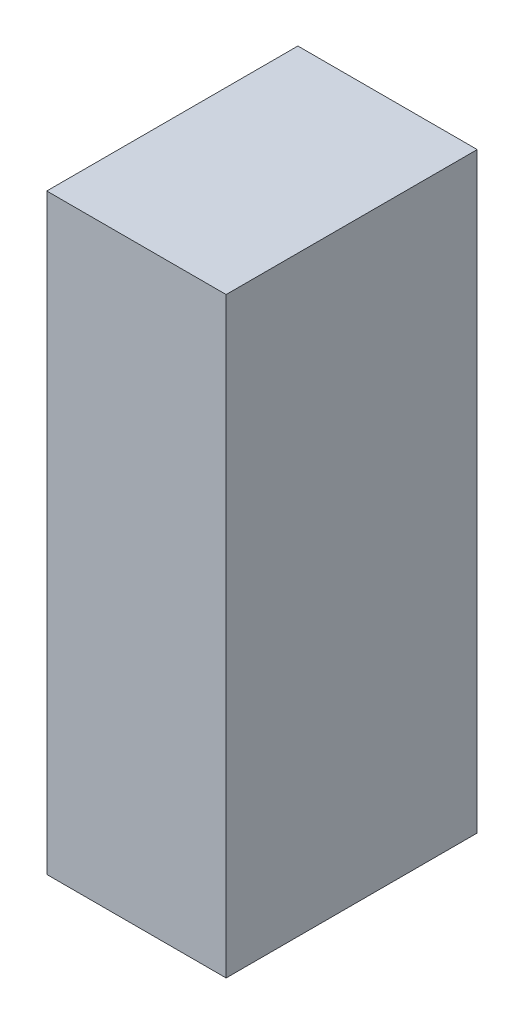
ISO-10303-21;
HEADER;
FILE_DESCRIPTION(('STEP AP214'),'2;1');
FILE_NAME('part.step','',(''),(''),'','','');
FILE_SCHEMA(('AUTOMOTIVE_DESIGN { 1 0 10303 214 1 1 1 1 }'));
ENDSEC;
DATA;
#1=APPLICATION_CONTEXT('core data for automotive mechanical design processes');
#2=APPLICATION_PROTOCOL_DEFINITION('international standard','automotive_design',2000,#1);
#3=PRODUCT_CONTEXT('',#1,'mechanical');
#4=PRODUCT('Part','Part','',(#3));
#5=PRODUCT_RELATED_PRODUCT_CATEGORY('part','',(#4));
#6=PRODUCT_DEFINITION_FORMATION('','',#4);
#7=PRODUCT_DEFINITION_CONTEXT('part definition',#1,'design');
#8=PRODUCT_DEFINITION('design','',#6,#7);
#9=PRODUCT_DEFINITION_SHAPE('','',#8);
#10=(LENGTH_UNIT() NAMED_UNIT(*) SI_UNIT(.MILLI.,.METRE.));
#11=(NAMED_UNIT(*) PLANE_ANGLE_UNIT() SI_UNIT($,.RADIAN.));
#12=(NAMED_UNIT(*) SI_UNIT($,.STERADIAN.) SOLID_ANGLE_UNIT());
#13=UNCERTAINTY_MEASURE_WITH_UNIT(LENGTH_MEASURE(1.E-05),#10,'distance_accuracy_value','');
#14=(GEOMETRIC_REPRESENTATION_CONTEXT(3) GLOBAL_UNCERTAINTY_ASSIGNED_CONTEXT((#13)) GLOBAL_UNIT_ASSIGNED_CONTEXT((#10,
#11,#12)) REPRESENTATION_CONTEXT('',''));
#15=CARTESIAN_POINT('',(0.,0.,0.));
#16=DIRECTION('',(0.,0.,1.));
#17=DIRECTION('',(1.,0.,0.));
#18=AXIS2_PLACEMENT_3D('',#15,#16,#17);
#19=CARTESIAN_POINT('',(1.1249893486867,-0.825011098017285,-2.84112203121185));
#20=DIRECTION('',(-1.19248806385031E-08,-1.,0.));
#21=DIRECTION('',(1.,-1.19248806385031E-08,0.));
#22=AXIS2_PLACEMENT_3D('',#19,#20,#21);
#23=PLANE('',#22);
#24=DIRECTION('',(1.,-1.19248805337978E-08,0.));
#25=VECTOR('',#24,1.);
#26=CARTESIAN_POINT('',(1.1249893486867,-0.825011098017285,-2.84112203121185));
#27=LINE('',#26,#25);
#28=CARTESIAN_POINT('',(1.1249893486867,-0.825011098017285,-2.84112203121185));
#29=VERTEX_POINT('',#28);
#30=CARTESIAN_POINT('',(1.62499697808123,-0.825011103979819,-2.84112203121185));
#31=VERTEX_POINT('',#30);
#32=EDGE_CURVE('E11',#29,#31,#27,.T.);
#33=ORIENTED_EDGE('',*,*,#32,.T.);
#34=DIRECTION('',(0.,0.,1.));
#35=VECTOR('',#34,1.);
#36=CARTESIAN_POINT('',(1.62499697808123,-0.825011103979816,-2.84112203121185));
#37=LINE('',#36,#35);
#38=CARTESIAN_POINT('',(1.62499697808123,-0.825011103979819,-2.14112091064453));
#39=VERTEX_POINT('',#38);
#40=EDGE_CURVE('E88',#31,#39,#37,.T.);
#41=ORIENTED_EDGE('',*,*,#40,.T.);
#42=DIRECTION('',(1.,-1.19248805337978E-08,0.));
#43=VECTOR('',#42,1.);
#44=CARTESIAN_POINT('',(1.1249893486867,-0.825011098017285,-2.14112091064453));
#45=LINE('',#44,#43);
#46=CARTESIAN_POINT('',(1.1249893486867,-0.825011098017285,-2.14112091064453));
#47=VERTEX_POINT('',#46);
#48=EDGE_CURVE('E83',#47,#39,#45,.T.);
#49=ORIENTED_EDGE('',*,*,#48,.F.);
#50=DIRECTION('',(0.,0.,1.));
#51=VECTOR('',#50,1.);
#52=CARTESIAN_POINT('',(1.1249893486867,-0.825011098017284,-2.84112203121185));
#53=LINE('',#52,#51);
#54=EDGE_CURVE('E72',#29,#47,#53,.T.);
#55=ORIENTED_EDGE('',*,*,#54,.F.);
#56=EDGE_LOOP('',(#33,#41,#49,#55));
#57=FACE_BOUND('',#56,.T.);
#58=ADVANCED_FACE('F17',(#57),#23,.T.);
#59=CARTESIAN_POINT('',(1.62499697808123,-0.825011103979819,-2.84112203121185));
#60=DIRECTION('',(1.,-1.19248806385031E-08,0.));
#61=DIRECTION('',(1.19248806385031E-08,1.,0.));
#62=AXIS2_PLACEMENT_3D('',#59,#60,#61);
#63=PLANE('',#62);
#64=DIRECTION('',(1.19248805831428E-08,1.,0.));
#65=VECTOR('',#64,1.);
#66=CARTESIAN_POINT('',(1.62499697808123,-0.825011103979819,-2.84112203121185));
#67=LINE('',#66,#65);
#68=CARTESIAN_POINT('',(1.62499699775721,0.824982792504557,-2.84112203121185));
#69=VERTEX_POINT('',#68);
#70=EDGE_CURVE('E24',#31,#69,#67,.T.);
#71=ORIENTED_EDGE('',*,*,#70,.T.);
#72=DIRECTION('',(0.,0.,1.));
#73=VECTOR('',#72,1.);
#74=CARTESIAN_POINT('',(1.62499699775721,0.824982792504556,-2.84112203121185));
#75=LINE('',#74,#73);
#76=CARTESIAN_POINT('',(1.62499699775721,0.824982792504557,-2.14112091064453));
#77=VERTEX_POINT('',#76);
#78=EDGE_CURVE('E85',#69,#77,#75,.T.);
#79=ORIENTED_EDGE('',*,*,#78,.T.);
#80=DIRECTION('',(1.19248805831428E-08,1.,0.));
#81=VECTOR('',#80,1.);
#82=CARTESIAN_POINT('',(1.62499697808123,-0.825011103979819,-2.14112091064453));
#83=LINE('',#82,#81);
#84=EDGE_CURVE('E66',#39,#77,#83,.T.);
#85=ORIENTED_EDGE('',*,*,#84,.F.);
#86=ORIENTED_EDGE('',*,*,#40,.F.);
#87=EDGE_LOOP('',(#71,#79,#85,#86));
#88=FACE_BOUND('',#87,.T.);
#89=ADVANCED_FACE('F89',(#88),#63,.T.);
#90=CARTESIAN_POINT('',(1.62499699775721,0.824982792504557,-2.84112203121185));
#91=DIRECTION('',(1.19248806385031E-08,1.,0.));
#92=DIRECTION('',(-1.,1.19248806385031E-08,0.));
#93=AXIS2_PLACEMENT_3D('',#90,#91,#92);
#94=PLANE('',#93);
#95=DIRECTION('',(-1.,1.19248805337978E-08,0.));
#96=VECTOR('',#95,1.);
#97=CARTESIAN_POINT('',(1.62499699775721,0.824982792504557,-2.84112203121185));
#98=LINE('',#97,#96);
#99=CARTESIAN_POINT('',(1.12498936836268,0.82498279846709,-2.84112203121185));
#100=VERTEX_POINT('',#99);
#101=EDGE_CURVE('E62',#69,#100,#98,.T.);
#102=ORIENTED_EDGE('',*,*,#101,.T.);
#103=DIRECTION('',(0.,0.,1.));
#104=VECTOR('',#103,1.);
#105=CARTESIAN_POINT('',(1.12498936836268,0.824982798467088,-2.84112203121185));
#106=LINE('',#105,#104);
#107=CARTESIAN_POINT('',(1.12498936836268,0.82498279846709,-2.14112091064453));
#108=VERTEX_POINT('',#107);
#109=EDGE_CURVE('E55',#100,#108,#106,.T.);
#110=ORIENTED_EDGE('',*,*,#109,.T.);
#111=DIRECTION('',(-1.,1.19248805337978E-08,0.));
#112=VECTOR('',#111,1.);
#113=CARTESIAN_POINT('',(1.62499699775721,0.824982792504557,-2.14112091064453));
#114=LINE('',#113,#112);
#115=EDGE_CURVE('E59',#77,#108,#114,.T.);
#116=ORIENTED_EDGE('',*,*,#115,.F.);
#117=ORIENTED_EDGE('',*,*,#78,.F.);
#118=EDGE_LOOP('',(#102,#110,#116,#117));
#119=FACE_BOUND('',#118,.T.);
#120=ADVANCED_FACE('F57',(#119),#94,.T.);
#121=CARTESIAN_POINT('',(1.12498936836268,0.82498279846709,-2.84112203121185));
#122=DIRECTION('',(-1.,1.19248806385031E-08,0.));
#123=DIRECTION('',(-1.19248806385031E-08,-1.,0.));
#124=AXIS2_PLACEMENT_3D('',#121,#122,#123);
#125=PLANE('',#124);
#126=DIRECTION('',(-1.19248805831428E-08,-1.,0.));
#127=VECTOR('',#126,1.);
#128=CARTESIAN_POINT('',(1.12498936836268,0.82498279846709,-2.84112203121185));
#129=LINE('',#128,#127);
#130=EDGE_CURVE('E65',#100,#29,#129,.T.);
#131=ORIENTED_EDGE('',*,*,#130,.T.);
#132=ORIENTED_EDGE('',*,*,#54,.T.);
#133=DIRECTION('',(-1.19248805831428E-08,-1.,0.));
#134=VECTOR('',#133,1.);
#135=CARTESIAN_POINT('',(1.12498936836268,0.82498279846709,-2.14112091064453));
#136=LINE('',#135,#134);
#137=EDGE_CURVE('E70',#108,#47,#136,.T.);
#138=ORIENTED_EDGE('',*,*,#137,.F.);
#139=ORIENTED_EDGE('',*,*,#109,.F.);
#140=EDGE_LOOP('',(#131,#132,#138,#139));
#141=FACE_BOUND('',#140,.T.);
#142=ADVANCED_FACE('F71',(#141),#125,.T.);
#143=CARTESIAN_POINT('',(94.1249923706055,-387.200012207031,-2.14112091064453));
#144=DIRECTION('',(0.,0.,1.));
#145=DIRECTION('',(1.19248806385031E-08,1.,0.));
#146=AXIS2_PLACEMENT_3D('',#143,#144,#145);
#147=PLANE('',#146);
#148=ORIENTED_EDGE('',*,*,#48,.T.);
#149=ORIENTED_EDGE('',*,*,#84,.T.);
#150=ORIENTED_EDGE('',*,*,#115,.T.);
#151=ORIENTED_EDGE('',*,*,#137,.T.);
#152=EDGE_LOOP('',(#148,#149,#150,#151));
#153=FACE_BOUND('',#152,.T.);
#154=ADVANCED_FACE('F76',(#153),#147,.T.);
#155=CARTESIAN_POINT('',(94.1249923706055,-387.200012207031,-2.84112203121185));
#156=DIRECTION('',(0.,0.,1.));
#157=DIRECTION('',(1.19248806385031E-08,1.,0.));
#158=AXIS2_PLACEMENT_3D('',#155,#156,#157);
#159=PLANE('',#158);
#160=ORIENTED_EDGE('',*,*,#130,.F.);
#161=ORIENTED_EDGE('',*,*,#101,.F.);
#162=ORIENTED_EDGE('',*,*,#70,.F.);
#163=ORIENTED_EDGE('',*,*,#32,.F.);
#164=EDGE_LOOP('',(#160,#161,#162,#163));
#165=FACE_BOUND('',#164,.T.);
#166=ADVANCED_FACE('F91',(#165),#159,.F.);
#167=CLOSED_SHELL('',(#58,#89,#120,#142,#154,#166));
#168=MANIFOLD_SOLID_BREP('B1',#167);
#169=ADVANCED_BREP_SHAPE_REPRESENTATION('',(#18,#168),#14);
#170=SHAPE_DEFINITION_REPRESENTATION(#9,#169);
ENDSEC;
END-ISO-10303-21;
